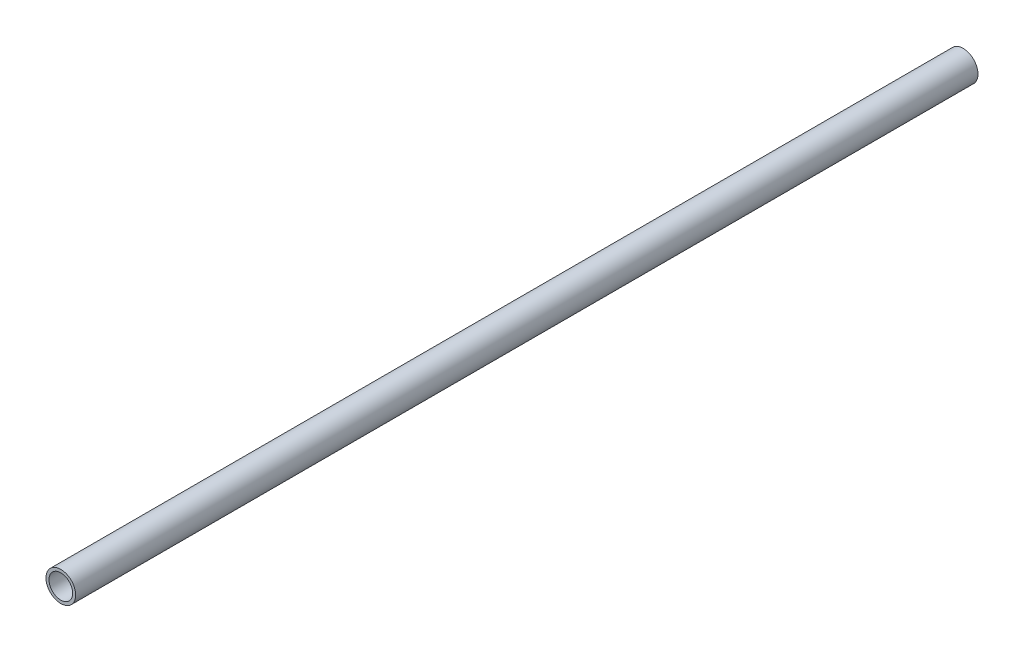
ISO-10303-21;
HEADER;
FILE_DESCRIPTION(('STEP AP214'),'2;1');
FILE_NAME('part.step','',(''),(''),'','','');
FILE_SCHEMA(('AUTOMOTIVE_DESIGN { 1 0 10303 214 1 1 1 1 }'));
ENDSEC;
DATA;
#1=APPLICATION_CONTEXT('core data for automotive mechanical design processes');
#2=APPLICATION_PROTOCOL_DEFINITION('international standard','automotive_design',2000,#1);
#3=PRODUCT_CONTEXT('',#1,'mechanical');
#4=PRODUCT('Part','Part','',(#3));
#5=PRODUCT_RELATED_PRODUCT_CATEGORY('part','',(#4));
#6=PRODUCT_DEFINITION_FORMATION('','',#4);
#7=PRODUCT_DEFINITION_CONTEXT('part definition',#1,'design');
#8=PRODUCT_DEFINITION('design','',#6,#7);
#9=PRODUCT_DEFINITION_SHAPE('','',#8);
#10=(LENGTH_UNIT() NAMED_UNIT(*) SI_UNIT(.MILLI.,.METRE.));
#11=(NAMED_UNIT(*) PLANE_ANGLE_UNIT() SI_UNIT($,.RADIAN.));
#12=(NAMED_UNIT(*) SI_UNIT($,.STERADIAN.) SOLID_ANGLE_UNIT());
#13=UNCERTAINTY_MEASURE_WITH_UNIT(LENGTH_MEASURE(1.E-05),#10,'distance_accuracy_value','');
#14=(GEOMETRIC_REPRESENTATION_CONTEXT(3) GLOBAL_UNCERTAINTY_ASSIGNED_CONTEXT((#13)) GLOBAL_UNIT_ASSIGNED_CONTEXT((#10,
#11,#12)) REPRESENTATION_CONTEXT('',''));
#15=CARTESIAN_POINT('',(0.,0.,0.));
#16=DIRECTION('',(0.,0.,1.));
#17=DIRECTION('',(1.,0.,0.));
#18=AXIS2_PLACEMENT_3D('',#15,#16,#17);
#19=CARTESIAN_POINT('',(0.,0.,-508.));
#20=DIRECTION('',(0.,0.,1.));
#21=DIRECTION('',(1.,0.,0.));
#22=AXIS2_PLACEMENT_3D('',#19,#20,#21);
#23=CYLINDRICAL_SURFACE('',#22,13.3223);
#24=CARTESIAN_POINT('',(0.,0.,508.));
#25=DIRECTION('',(0.,0.,1.));
#26=DIRECTION('',(1.,0.,0.));
#27=AXIS2_PLACEMENT_3D('',#24,#25,#26);
#28=CIRCLE('',#27,13.3223);
#29=CARTESIAN_POINT('',(13.3223,0.,508.));
#30=VERTEX_POINT('',#29);
#31=EDGE_CURVE('E18',#30,#30,#28,.F.);
#32=ORIENTED_EDGE('',*,*,#31,.F.);
#33=EDGE_LOOP('',(#32));
#34=FACE_BOUND('',#33,.T.);
#35=CARTESIAN_POINT('',(0.,0.,-508.));
#36=DIRECTION('',(0.,0.,1.));
#37=DIRECTION('',(1.,0.,0.));
#38=AXIS2_PLACEMENT_3D('',#35,#36,#37);
#39=CIRCLE('',#38,13.3223);
#40=CARTESIAN_POINT('',(13.3223,0.,-508.));
#41=VERTEX_POINT('',#40);
#42=EDGE_CURVE('E27',#41,#41,#39,.F.);
#43=ORIENTED_EDGE('',*,*,#42,.T.);
#44=EDGE_LOOP('',(#43));
#45=FACE_BOUND('',#44,.T.);
#46=ADVANCED_FACE('F15',(#34,#45),#23,.F.);
#47=CARTESIAN_POINT('',(0.,0.,508.));
#48=DIRECTION('',(0.,0.,1.));
#49=DIRECTION('',(1.,0.,0.));
#50=AXIS2_PLACEMENT_3D('',#47,#48,#49);
#51=PLANE('',#50);
#52=ORIENTED_EDGE('',*,*,#31,.T.);
#53=EDGE_LOOP('',(#52));
#54=FACE_BOUND('',#53,.T.);
#55=CARTESIAN_POINT('',(0.,0.,508.));
#56=DIRECTION('',(0.,0.,1.));
#57=DIRECTION('',(1.,0.,0.));
#58=AXIS2_PLACEMENT_3D('',#55,#56,#57);
#59=CIRCLE('',#58,16.7005);
#60=CARTESIAN_POINT('',(16.7005,0.,508.));
#61=VERTEX_POINT('',#60);
#62=EDGE_CURVE('E22',#61,#61,#59,.F.);
#63=ORIENTED_EDGE('',*,*,#62,.F.);
#64=EDGE_LOOP('',(#63));
#65=FACE_BOUND('',#64,.T.);
#66=ADVANCED_FACE('F35',(#54,#65),#51,.T.);
#67=CARTESIAN_POINT('',(0.,0.,-508.));
#68=DIRECTION('',(0.,0.,1.));
#69=DIRECTION('',(1.,0.,0.));
#70=AXIS2_PLACEMENT_3D('',#67,#68,#69);
#71=PLANE('',#70);
#72=ORIENTED_EDGE('',*,*,#42,.F.);
#73=EDGE_LOOP('',(#72));
#74=FACE_BOUND('',#73,.T.);
#75=CARTESIAN_POINT('',(0.,0.,-508.));
#76=DIRECTION('',(0.,0.,1.));
#77=DIRECTION('',(1.,0.,0.));
#78=AXIS2_PLACEMENT_3D('',#75,#76,#77);
#79=CIRCLE('',#78,16.7005);
#80=CARTESIAN_POINT('',(16.7005,0.,-508.));
#81=VERTEX_POINT('',#80);
#82=EDGE_CURVE('E10',#81,#81,#79,.T.);
#83=ORIENTED_EDGE('',*,*,#82,.F.);
#84=EDGE_LOOP('',(#83));
#85=FACE_BOUND('',#84,.T.);
#86=ADVANCED_FACE('F43',(#74,#85),#71,.F.);
#87=CARTESIAN_POINT('',(0.,0.,-508.));
#88=DIRECTION('',(0.,0.,1.));
#89=DIRECTION('',(1.,0.,0.));
#90=AXIS2_PLACEMENT_3D('',#87,#88,#89);
#91=CYLINDRICAL_SURFACE('',#90,16.7005);
#92=ORIENTED_EDGE('',*,*,#62,.T.);
#93=EDGE_LOOP('',(#92));
#94=FACE_BOUND('',#93,.T.);
#95=ORIENTED_EDGE('',*,*,#82,.T.);
#96=EDGE_LOOP('',(#95));
#97=FACE_BOUND('',#96,.T.);
#98=ADVANCED_FACE('F44',(#94,#97),#91,.T.);
#99=CLOSED_SHELL('',(#46,#66,#86,#98));
#100=MANIFOLD_SOLID_BREP('B1',#99);
#101=ADVANCED_BREP_SHAPE_REPRESENTATION('',(#18,#100),#14);
#102=SHAPE_DEFINITION_REPRESENTATION(#9,#101);
ENDSEC;
END-ISO-10303-21;
